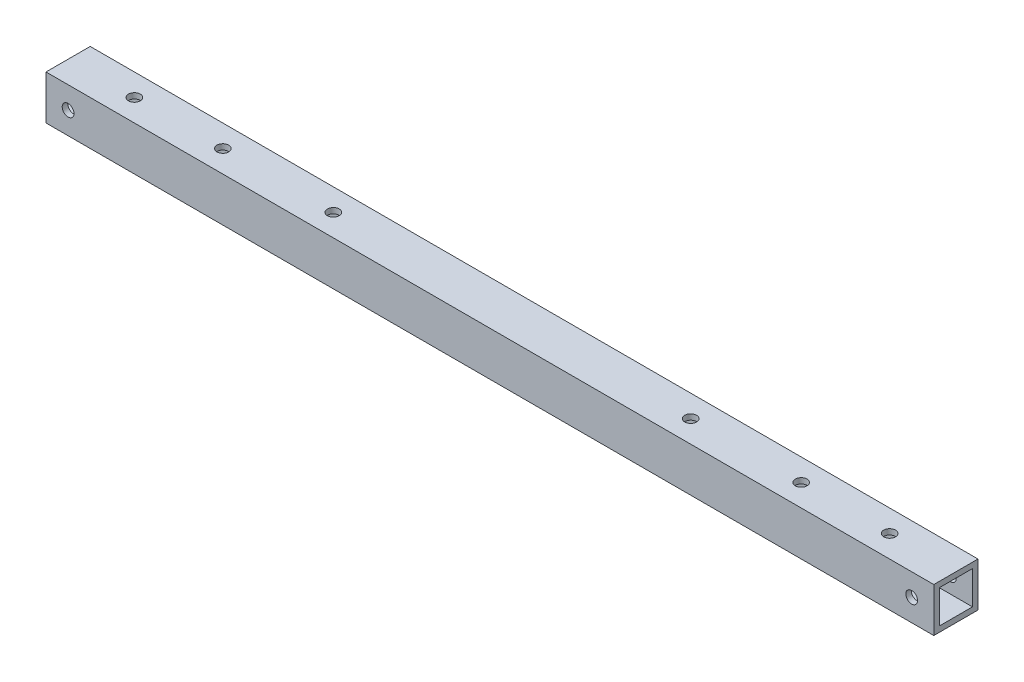
ISO-10303-21;
HEADER;
FILE_DESCRIPTION(('STEP AP214'),'2;1');
FILE_NAME('part.step','',(''),(''),'','','');
FILE_SCHEMA(('AUTOMOTIVE_DESIGN { 1 0 10303 214 1 1 1 1 }'));
ENDSEC;
DATA;
#1=APPLICATION_CONTEXT('core data for automotive mechanical design processes');
#2=APPLICATION_PROTOCOL_DEFINITION('international standard','automotive_design',2000,#1);
#3=PRODUCT_CONTEXT('',#1,'mechanical');
#4=PRODUCT('Part','Part','',(#3));
#5=PRODUCT_RELATED_PRODUCT_CATEGORY('part','',(#4));
#6=PRODUCT_DEFINITION_FORMATION('','',#4);
#7=PRODUCT_DEFINITION_CONTEXT('part definition',#1,'design');
#8=PRODUCT_DEFINITION('design','',#6,#7);
#9=PRODUCT_DEFINITION_SHAPE('','',#8);
#10=(LENGTH_UNIT() NAMED_UNIT(*) SI_UNIT(.MILLI.,.METRE.));
#11=(NAMED_UNIT(*) PLANE_ANGLE_UNIT() SI_UNIT($,.RADIAN.));
#12=(NAMED_UNIT(*) SI_UNIT($,.STERADIAN.) SOLID_ANGLE_UNIT());
#13=UNCERTAINTY_MEASURE_WITH_UNIT(LENGTH_MEASURE(1.E-05),#10,'distance_accuracy_value','');
#14=(GEOMETRIC_REPRESENTATION_CONTEXT(3) GLOBAL_UNCERTAINTY_ASSIGNED_CONTEXT((#13)) GLOBAL_UNIT_ASSIGNED_CONTEXT((#10,
#11,#12)) REPRESENTATION_CONTEXT('',''));
#15=CARTESIAN_POINT('',(0.,0.,0.));
#16=DIRECTION('',(0.,0.,1.));
#17=DIRECTION('',(1.,0.,0.));
#18=AXIS2_PLACEMENT_3D('',#15,#16,#17);
#19=CARTESIAN_POINT('',(241.,0.,0.));
#20=DIRECTION('',(1.,0.,0.));
#21=DIRECTION('',(0.,0.,-1.));
#22=AXIS2_PLACEMENT_3D('',#19,#20,#21);
#23=PLANE('',#22);
#24=DIRECTION('',(0.,1.,0.));
#25=VECTOR('',#24,1.);
#26=CARTESIAN_POINT('',(241.,12.,-12.));
#27=LINE('',#26,#25);
#28=CARTESIAN_POINT('',(241.,0.,-12.));
#29=VERTEX_POINT('',#28);
#30=CARTESIAN_POINT('',(241.,12.,-12.));
#31=VERTEX_POINT('',#30);
#32=EDGE_CURVE('E142',#29,#31,#27,.T.);
#33=ORIENTED_EDGE('',*,*,#32,.T.);
#34=DIRECTION('',(0.,0.,1.));
#35=VECTOR('',#34,1.);
#36=CARTESIAN_POINT('',(241.,12.,0.));
#37=LINE('',#36,#35);
#38=CARTESIAN_POINT('',(241.,12.,0.));
#39=VERTEX_POINT('',#38);
#40=EDGE_CURVE('E145',#31,#39,#37,.T.);
#41=ORIENTED_EDGE('',*,*,#40,.T.);
#42=DIRECTION('',(0.,-1.,0.));
#43=VECTOR('',#42,1.);
#44=CARTESIAN_POINT('',(241.,12.,0.));
#45=LINE('',#44,#43);
#46=CARTESIAN_POINT('',(241.,0.,0.));
#47=VERTEX_POINT('',#46);
#48=EDGE_CURVE('E148',#39,#47,#45,.T.);
#49=ORIENTED_EDGE('',*,*,#48,.T.);
#50=DIRECTION('',(0.,0.,-1.));
#51=VECTOR('',#50,1.);
#52=CARTESIAN_POINT('',(241.,0.,0.));
#53=LINE('',#52,#51);
#54=EDGE_CURVE('E150',#47,#29,#53,.T.);
#55=ORIENTED_EDGE('',*,*,#54,.T.);
#56=EDGE_LOOP('',(#33,#41,#49,#55));
#57=FACE_BOUND('',#56,.T.);
#58=DIRECTION('',(0.,0.,-1.));
#59=VECTOR('',#58,1.);
#60=CARTESIAN_POINT('',(241.,1.5,-1.5));
#61=LINE('',#60,#59);
#62=CARTESIAN_POINT('',(241.,1.5,-1.5));
#63=VERTEX_POINT('',#62);
#64=CARTESIAN_POINT('',(241.,1.5,-10.5));
#65=VERTEX_POINT('',#64);
#66=EDGE_CURVE('E112',#63,#65,#61,.T.);
#67=ORIENTED_EDGE('',*,*,#66,.F.);
#68=DIRECTION('',(0.,-1.,0.));
#69=VECTOR('',#68,1.);
#70=CARTESIAN_POINT('',(241.,10.5,-1.5));
#71=LINE('',#70,#69);
#72=CARTESIAN_POINT('',(241.,10.5,-1.5));
#73=VERTEX_POINT('',#72);
#74=EDGE_CURVE('E104',#73,#63,#71,.T.);
#75=ORIENTED_EDGE('',*,*,#74,.F.);
#76=DIRECTION('',(0.,0.,1.));
#77=VECTOR('',#76,1.);
#78=CARTESIAN_POINT('',(241.,10.5,-1.5));
#79=LINE('',#78,#77);
#80=CARTESIAN_POINT('',(241.,10.5,-10.5));
#81=VERTEX_POINT('',#80);
#82=EDGE_CURVE('E126',#81,#73,#79,.T.);
#83=ORIENTED_EDGE('',*,*,#82,.F.);
#84=DIRECTION('',(0.,1.,0.));
#85=VECTOR('',#84,1.);
#86=CARTESIAN_POINT('',(241.,10.5,-10.5));
#87=LINE('',#86,#85);
#88=EDGE_CURVE('E124',#65,#81,#87,.T.);
#89=ORIENTED_EDGE('',*,*,#88,.F.);
#90=EDGE_LOOP('',(#67,#75,#83,#89));
#91=FACE_BOUND('',#90,.T.);
#92=ADVANCED_FACE('F37',(#57,#91),#23,.T.);
#93=CARTESIAN_POINT('',(0.,0.,0.));
#94=DIRECTION('',(1.,0.,0.));
#95=DIRECTION('',(0.,0.,-1.));
#96=AXIS2_PLACEMENT_3D('',#93,#94,#95);
#97=PLANE('',#96);
#98=DIRECTION('',(0.,1.,0.));
#99=VECTOR('',#98,1.);
#100=CARTESIAN_POINT('',(0.,12.,-12.));
#101=LINE('',#100,#99);
#102=CARTESIAN_POINT('',(0.,0.,-12.));
#103=VERTEX_POINT('',#102);
#104=CARTESIAN_POINT('',(0.,12.,-12.));
#105=VERTEX_POINT('',#104);
#106=EDGE_CURVE('E120',#103,#105,#101,.T.);
#107=ORIENTED_EDGE('',*,*,#106,.F.);
#108=DIRECTION('',(0.,0.,-1.));
#109=VECTOR('',#108,1.);
#110=CARTESIAN_POINT('',(0.,0.,0.));
#111=LINE('',#110,#109);
#112=CARTESIAN_POINT('',(0.,0.,0.));
#113=VERTEX_POINT('',#112);
#114=EDGE_CURVE('E146',#113,#103,#111,.T.);
#115=ORIENTED_EDGE('',*,*,#114,.F.);
#116=DIRECTION('',(0.,-1.,0.));
#117=VECTOR('',#116,1.);
#118=CARTESIAN_POINT('',(0.,12.,0.));
#119=LINE('',#118,#117);
#120=CARTESIAN_POINT('',(0.,12.,0.));
#121=VERTEX_POINT('',#120);
#122=EDGE_CURVE('E157',#121,#113,#119,.T.);
#123=ORIENTED_EDGE('',*,*,#122,.F.);
#124=DIRECTION('',(0.,0.,1.));
#125=VECTOR('',#124,1.);
#126=CARTESIAN_POINT('',(0.,12.,0.));
#127=LINE('',#126,#125);
#128=EDGE_CURVE('E155',#105,#121,#127,.T.);
#129=ORIENTED_EDGE('',*,*,#128,.F.);
#130=EDGE_LOOP('',(#107,#115,#123,#129));
#131=FACE_BOUND('',#130,.T.);
#132=DIRECTION('',(0.,-1.,0.));
#133=VECTOR('',#132,1.);
#134=CARTESIAN_POINT('',(0.,10.5,-1.5));
#135=LINE('',#134,#133);
#136=CARTESIAN_POINT('',(0.,10.5,-1.5));
#137=VERTEX_POINT('',#136);
#138=CARTESIAN_POINT('',(0.,1.5,-1.5));
#139=VERTEX_POINT('',#138);
#140=EDGE_CURVE('E62',#137,#139,#135,.T.);
#141=ORIENTED_EDGE('',*,*,#140,.T.);
#142=DIRECTION('',(0.,0.,-1.));
#143=VECTOR('',#142,1.);
#144=CARTESIAN_POINT('',(0.,1.5,-1.5));
#145=LINE('',#144,#143);
#146=CARTESIAN_POINT('',(0.,1.5,-10.5));
#147=VERTEX_POINT('',#146);
#148=EDGE_CURVE('E119',#139,#147,#145,.T.);
#149=ORIENTED_EDGE('',*,*,#148,.T.);
#150=DIRECTION('',(0.,1.,0.));
#151=VECTOR('',#150,1.);
#152=CARTESIAN_POINT('',(0.,10.5,-10.5));
#153=LINE('',#152,#151);
#154=CARTESIAN_POINT('',(0.,10.5,-10.5));
#155=VERTEX_POINT('',#154);
#156=EDGE_CURVE('E134',#147,#155,#153,.T.);
#157=ORIENTED_EDGE('',*,*,#156,.T.);
#158=DIRECTION('',(0.,0.,1.));
#159=VECTOR('',#158,1.);
#160=CARTESIAN_POINT('',(0.,10.5,-1.5));
#161=LINE('',#160,#159);
#162=EDGE_CURVE('E113',#155,#137,#161,.T.);
#163=ORIENTED_EDGE('',*,*,#162,.T.);
#164=EDGE_LOOP('',(#141,#149,#157,#163));
#165=FACE_BOUND('',#164,.T.);
#166=ADVANCED_FACE('F273',(#131,#165),#97,.F.);
#167=CARTESIAN_POINT('',(241.,12.,-12.));
#168=DIRECTION('',(0.,0.,1.));
#169=DIRECTION('',(0.,-1.,0.));
#170=AXIS2_PLACEMENT_3D('',#167,#168,#169);
#171=PLANE('',#170);
#172=CARTESIAN_POINT('',(6.,6.,-12.));
#173=DIRECTION('',(0.,0.,1.));
#174=DIRECTION('',(1.,0.,0.));
#175=AXIS2_PLACEMENT_3D('',#172,#173,#174);
#176=CIRCLE('',#175,1.6);
#177=CARTESIAN_POINT('',(7.6,6.,-12.));
#178=VERTEX_POINT('',#177);
#179=EDGE_CURVE('E179',#178,#178,#176,.T.);
#180=ORIENTED_EDGE('',*,*,#179,.T.);
#181=EDGE_LOOP('',(#180));
#182=FACE_BOUND('',#181,.T.);
#183=CARTESIAN_POINT('',(235.,6.,-12.));
#184=DIRECTION('',(0.,0.,1.));
#185=DIRECTION('',(1.,0.,0.));
#186=AXIS2_PLACEMENT_3D('',#183,#184,#185);
#187=CIRCLE('',#186,1.59999999999996);
#188=CARTESIAN_POINT('',(236.6,6.,-12.));
#189=VERTEX_POINT('',#188);
#190=EDGE_CURVE('E215',#189,#189,#187,.T.);
#191=ORIENTED_EDGE('',*,*,#190,.T.);
#192=EDGE_LOOP('',(#191));
#193=FACE_BOUND('',#192,.T.);
#194=ORIENTED_EDGE('',*,*,#106,.T.);
#195=DIRECTION('',(-1.,0.,0.));
#196=VECTOR('',#195,1.);
#197=CARTESIAN_POINT('',(241.,12.,-12.));
#198=LINE('',#197,#196);
#199=EDGE_CURVE('E11',#31,#105,#198,.T.);
#200=ORIENTED_EDGE('',*,*,#199,.F.);
#201=ORIENTED_EDGE('',*,*,#32,.F.);
#202=DIRECTION('',(-1.,0.,0.));
#203=VECTOR('',#202,1.);
#204=CARTESIAN_POINT('',(241.,0.,-12.));
#205=LINE('',#204,#203);
#206=EDGE_CURVE('E152',#29,#103,#205,.T.);
#207=ORIENTED_EDGE('',*,*,#206,.T.);
#208=EDGE_LOOP('',(#194,#200,#201,#207));
#209=FACE_BOUND('',#208,.T.);
#210=ADVANCED_FACE('F39',(#182,#193,#209),#171,.F.);
#211=CARTESIAN_POINT('',(241.,12.,0.));
#212=DIRECTION('',(0.,-1.,0.));
#213=DIRECTION('',(0.,0.,-1.));
#214=AXIS2_PLACEMENT_3D('',#211,#212,#213);
#215=PLANE('',#214);
#216=CARTESIAN_POINT('',(42.,12.,-5.99999999999996));
#217=DIRECTION('',(0.,-1.,0.));
#218=DIRECTION('',(0.,0.,-1.));
#219=AXIS2_PLACEMENT_3D('',#216,#217,#218);
#220=CIRCLE('',#219,1.6);
#221=CARTESIAN_POINT('',(42.,12.,-7.59999999999996));
#222=VERTEX_POINT('',#221);
#223=EDGE_CURVE('E361',#222,#222,#220,.T.);
#224=ORIENTED_EDGE('',*,*,#223,.T.);
#225=EDGE_LOOP('',(#224));
#226=FACE_BOUND('',#225,.T.);
#227=CARTESIAN_POINT('',(199.,12.,-6.00000000000003));
#228=DIRECTION('',(0.,-1.,0.));
#229=DIRECTION('',(0.,0.,-1.));
#230=AXIS2_PLACEMENT_3D('',#227,#228,#229);
#231=CIRCLE('',#230,1.59999999999999);
#232=CARTESIAN_POINT('',(199.,12.,-7.60000000000002));
#233=VERTEX_POINT('',#232);
#234=EDGE_CURVE('E368',#233,#233,#231,.T.);
#235=ORIENTED_EDGE('',*,*,#234,.T.);
#236=EDGE_LOOP('',(#235));
#237=FACE_BOUND('',#236,.T.);
#238=CARTESIAN_POINT('',(169.,12.,-6.00000000000003));
#239=DIRECTION('',(0.,-1.,0.));
#240=DIRECTION('',(0.,0.,-1.));
#241=AXIS2_PLACEMENT_3D('',#238,#239,#240);
#242=CIRCLE('',#241,1.59999999999999);
#243=CARTESIAN_POINT('',(169.,12.,-7.60000000000002));
#244=VERTEX_POINT('',#243);
#245=EDGE_CURVE('E355',#244,#244,#242,.T.);
#246=ORIENTED_EDGE('',*,*,#245,.T.);
#247=EDGE_LOOP('',(#246));
#248=FACE_BOUND('',#247,.T.);
#249=CARTESIAN_POINT('',(72.,12.,-5.99999999999996));
#250=DIRECTION('',(0.,-1.,0.));
#251=DIRECTION('',(0.,0.,-1.));
#252=AXIS2_PLACEMENT_3D('',#249,#250,#251);
#253=CIRCLE('',#252,1.60000000000001);
#254=CARTESIAN_POINT('',(72.,12.,-7.59999999999996));
#255=VERTEX_POINT('',#254);
#256=EDGE_CURVE('E188',#255,#255,#253,.T.);
#257=ORIENTED_EDGE('',*,*,#256,.T.);
#258=EDGE_LOOP('',(#257));
#259=FACE_BOUND('',#258,.T.);
#260=CARTESIAN_POINT('',(18.,12.,-6.));
#261=DIRECTION('',(0.,1.,0.));
#262=DIRECTION('',(0.,0.,1.));
#263=AXIS2_PLACEMENT_3D('',#260,#261,#262);
#264=CIRCLE('',#263,1.6);
#265=CARTESIAN_POINT('',(18.,12.,-4.4));
#266=VERTEX_POINT('',#265);
#267=EDGE_CURVE('E227',#266,#266,#264,.T.);
#268=ORIENTED_EDGE('',*,*,#267,.F.);
#269=EDGE_LOOP('',(#268));
#270=FACE_BOUND('',#269,.T.);
#271=CARTESIAN_POINT('',(223.,12.,-6.));
#272=DIRECTION('',(0.,1.,0.));
#273=DIRECTION('',(0.,0.,1.));
#274=AXIS2_PLACEMENT_3D('',#271,#272,#273);
#275=CIRCLE('',#274,1.59999999999996);
#276=CARTESIAN_POINT('',(223.,12.,-4.40000000000004));
#277=VERTEX_POINT('',#276);
#278=EDGE_CURVE('E224',#277,#277,#275,.T.);
#279=ORIENTED_EDGE('',*,*,#278,.F.);
#280=EDGE_LOOP('',(#279));
#281=FACE_BOUND('',#280,.T.);
#282=ORIENTED_EDGE('',*,*,#128,.T.);
#283=DIRECTION('',(-1.,0.,0.));
#284=VECTOR('',#283,1.);
#285=CARTESIAN_POINT('',(241.,12.,0.));
#286=LINE('',#285,#284);
#287=EDGE_CURVE('E46',#39,#121,#286,.T.);
#288=ORIENTED_EDGE('',*,*,#287,.F.);
#289=ORIENTED_EDGE('',*,*,#40,.F.);
#290=ORIENTED_EDGE('',*,*,#199,.T.);
#291=EDGE_LOOP('',(#282,#288,#289,#290));
#292=FACE_BOUND('',#291,.T.);
#293=ADVANCED_FACE('F277',(#226,#237,#248,#259,#270,#281,#292),#215,.F.);
#294=CARTESIAN_POINT('',(241.,12.,0.));
#295=DIRECTION('',(0.,0.,-1.));
#296=DIRECTION('',(0.,1.,0.));
#297=AXIS2_PLACEMENT_3D('',#294,#295,#296);
#298=PLANE('',#297);
#299=CARTESIAN_POINT('',(6.,6.,0.));
#300=DIRECTION('',(0.,0.,1.));
#301=DIRECTION('',(1.,0.,0.));
#302=AXIS2_PLACEMENT_3D('',#299,#300,#301);
#303=CIRCLE('',#302,1.6);
#304=CARTESIAN_POINT('',(7.6,6.,0.));
#305=VERTEX_POINT('',#304);
#306=EDGE_CURVE('E212',#305,#305,#303,.T.);
#307=ORIENTED_EDGE('',*,*,#306,.F.);
#308=EDGE_LOOP('',(#307));
#309=FACE_BOUND('',#308,.T.);
#310=CARTESIAN_POINT('',(235.,6.,0.));
#311=DIRECTION('',(0.,0.,1.));
#312=DIRECTION('',(1.,0.,0.));
#313=AXIS2_PLACEMENT_3D('',#310,#311,#312);
#314=CIRCLE('',#313,1.59999999999996);
#315=CARTESIAN_POINT('',(236.6,6.,0.));
#316=VERTEX_POINT('',#315);
#317=EDGE_CURVE('E209',#316,#316,#314,.T.);
#318=ORIENTED_EDGE('',*,*,#317,.F.);
#319=EDGE_LOOP('',(#318));
#320=FACE_BOUND('',#319,.T.);
#321=ORIENTED_EDGE('',*,*,#122,.T.);
#322=DIRECTION('',(-1.,0.,0.));
#323=VECTOR('',#322,1.);
#324=CARTESIAN_POINT('',(241.,0.,0.));
#325=LINE('',#324,#323);
#326=EDGE_CURVE('E162',#47,#113,#325,.T.);
#327=ORIENTED_EDGE('',*,*,#326,.F.);
#328=ORIENTED_EDGE('',*,*,#48,.F.);
#329=ORIENTED_EDGE('',*,*,#287,.T.);
#330=EDGE_LOOP('',(#321,#327,#328,#329));
#331=FACE_BOUND('',#330,.T.);
#332=ADVANCED_FACE('F260',(#309,#320,#331),#298,.F.);
#333=CARTESIAN_POINT('',(241.,0.,0.));
#334=DIRECTION('',(0.,1.,0.));
#335=DIRECTION('',(0.,0.,1.));
#336=AXIS2_PLACEMENT_3D('',#333,#334,#335);
#337=PLANE('',#336);
#338=CARTESIAN_POINT('',(42.,0.,-5.99999999999996));
#339=DIRECTION('',(0.,-1.,0.));
#340=DIRECTION('',(0.,0.,-1.));
#341=AXIS2_PLACEMENT_3D('',#338,#339,#340);
#342=CIRCLE('',#341,1.6);
#343=CARTESIAN_POINT('',(42.,0.,-7.59999999999996));
#344=VERTEX_POINT('',#343);
#345=EDGE_CURVE('E365',#344,#344,#342,.T.);
#346=ORIENTED_EDGE('',*,*,#345,.F.);
#347=EDGE_LOOP('',(#346));
#348=FACE_BOUND('',#347,.T.);
#349=CARTESIAN_POINT('',(199.,0.,-6.00000000000003));
#350=DIRECTION('',(0.,-1.,0.));
#351=DIRECTION('',(0.,0.,-1.));
#352=AXIS2_PLACEMENT_3D('',#349,#350,#351);
#353=CIRCLE('',#352,1.59999999999999);
#354=CARTESIAN_POINT('',(199.,0.,-7.60000000000002));
#355=VERTEX_POINT('',#354);
#356=EDGE_CURVE('E358',#355,#355,#353,.T.);
#357=ORIENTED_EDGE('',*,*,#356,.F.);
#358=EDGE_LOOP('',(#357));
#359=FACE_BOUND('',#358,.T.);
#360=CARTESIAN_POINT('',(169.,0.,-6.00000000000003));
#361=DIRECTION('',(0.,-1.,0.));
#362=DIRECTION('',(0.,0.,-1.));
#363=AXIS2_PLACEMENT_3D('',#360,#361,#362);
#364=CIRCLE('',#363,1.59999999999999);
#365=CARTESIAN_POINT('',(169.,0.,-7.60000000000002));
#366=VERTEX_POINT('',#365);
#367=EDGE_CURVE('E353',#366,#366,#364,.T.);
#368=ORIENTED_EDGE('',*,*,#367,.F.);
#369=EDGE_LOOP('',(#368));
#370=FACE_BOUND('',#369,.T.);
#371=CARTESIAN_POINT('',(72.,0.,-5.99999999999996));
#372=DIRECTION('',(0.,-1.,0.));
#373=DIRECTION('',(0.,0.,-1.));
#374=AXIS2_PLACEMENT_3D('',#371,#372,#373);
#375=CIRCLE('',#374,1.60000000000001);
#376=CARTESIAN_POINT('',(72.,0.,-7.59999999999996));
#377=VERTEX_POINT('',#376);
#378=EDGE_CURVE('E364',#377,#377,#375,.T.);
#379=ORIENTED_EDGE('',*,*,#378,.F.);
#380=EDGE_LOOP('',(#379));
#381=FACE_BOUND('',#380,.T.);
#382=CARTESIAN_POINT('',(18.,0.,-6.));
#383=DIRECTION('',(0.,1.,0.));
#384=DIRECTION('',(0.,0.,1.));
#385=AXIS2_PLACEMENT_3D('',#382,#383,#384);
#386=CIRCLE('',#385,1.6);
#387=CARTESIAN_POINT('',(18.,0.,-4.4));
#388=VERTEX_POINT('',#387);
#389=EDGE_CURVE('E171',#388,#388,#386,.T.);
#390=ORIENTED_EDGE('',*,*,#389,.T.);
#391=EDGE_LOOP('',(#390));
#392=FACE_BOUND('',#391,.T.);
#393=CARTESIAN_POINT('',(223.,0.,-6.));
#394=DIRECTION('',(0.,1.,0.));
#395=DIRECTION('',(0.,0.,1.));
#396=AXIS2_PLACEMENT_3D('',#393,#394,#395);
#397=CIRCLE('',#396,1.59999999999996);
#398=CARTESIAN_POINT('',(223.,0.,-4.40000000000004));
#399=VERTEX_POINT('',#398);
#400=EDGE_CURVE('E230',#399,#399,#397,.T.);
#401=ORIENTED_EDGE('',*,*,#400,.T.);
#402=EDGE_LOOP('',(#401));
#403=FACE_BOUND('',#402,.T.);
#404=ORIENTED_EDGE('',*,*,#114,.T.);
#405=ORIENTED_EDGE('',*,*,#206,.F.);
#406=ORIENTED_EDGE('',*,*,#54,.F.);
#407=ORIENTED_EDGE('',*,*,#326,.T.);
#408=EDGE_LOOP('',(#404,#405,#406,#407));
#409=FACE_BOUND('',#408,.T.);
#410=ADVANCED_FACE('F257',(#348,#359,#370,#381,#392,#403,#409),#337,.F.);
#411=CARTESIAN_POINT('',(241.,10.5,-1.5));
#412=DIRECTION('',(0.,0.,-1.));
#413=DIRECTION('',(-1.,0.,0.));
#414=AXIS2_PLACEMENT_3D('',#411,#412,#413);
#415=PLANE('',#414);
#416=CARTESIAN_POINT('',(6.,6.,-1.5));
#417=DIRECTION('',(0.,0.,-1.));
#418=DIRECTION('',(-1.,0.,0.));
#419=AXIS2_PLACEMENT_3D('',#416,#417,#418);
#420=CIRCLE('',#419,1.6);
#421=CARTESIAN_POINT('',(4.4,6.,-1.5));
#422=VERTEX_POINT('',#421);
#423=EDGE_CURVE('E183',#422,#422,#420,.T.);
#424=ORIENTED_EDGE('',*,*,#423,.F.);
#425=EDGE_LOOP('',(#424));
#426=FACE_BOUND('',#425,.T.);
#427=CARTESIAN_POINT('',(235.,6.,-1.5));
#428=DIRECTION('',(0.,0.,-1.));
#429=DIRECTION('',(-1.,0.,0.));
#430=AXIS2_PLACEMENT_3D('',#427,#428,#429);
#431=CIRCLE('',#430,1.59999999999996);
#432=CARTESIAN_POINT('',(233.4,6.,-1.5));
#433=VERTEX_POINT('',#432);
#434=EDGE_CURVE('E178',#433,#433,#431,.T.);
#435=ORIENTED_EDGE('',*,*,#434,.F.);
#436=EDGE_LOOP('',(#435));
#437=FACE_BOUND('',#436,.T.);
#438=ORIENTED_EDGE('',*,*,#140,.F.);
#439=DIRECTION('',(-1.,0.,0.));
#440=VECTOR('',#439,1.);
#441=CARTESIAN_POINT('',(241.,10.5,-1.5));
#442=LINE('',#441,#440);
#443=EDGE_CURVE('E108',#73,#137,#442,.T.);
#444=ORIENTED_EDGE('',*,*,#443,.F.);
#445=ORIENTED_EDGE('',*,*,#74,.T.);
#446=DIRECTION('',(-1.,0.,0.));
#447=VECTOR('',#446,1.);
#448=CARTESIAN_POINT('',(241.,1.5,-1.5));
#449=LINE('',#448,#447);
#450=EDGE_CURVE('E107',#63,#139,#449,.T.);
#451=ORIENTED_EDGE('',*,*,#450,.T.);
#452=EDGE_LOOP('',(#438,#444,#445,#451));
#453=FACE_BOUND('',#452,.T.);
#454=ADVANCED_FACE('F106',(#426,#437,#453),#415,.T.);
#455=CARTESIAN_POINT('',(241.,1.5,-1.5));
#456=DIRECTION('',(0.,1.,0.));
#457=DIRECTION('',(0.,0.,1.));
#458=AXIS2_PLACEMENT_3D('',#455,#456,#457);
#459=PLANE('',#458);
#460=CARTESIAN_POINT('',(42.,1.5,-5.99999999999996));
#461=DIRECTION('',(0.,1.,0.));
#462=DIRECTION('',(0.,0.,1.));
#463=AXIS2_PLACEMENT_3D('',#460,#461,#462);
#464=CIRCLE('',#463,1.6);
#465=CARTESIAN_POINT('',(42.,1.5,-4.39999999999996));
#466=VERTEX_POINT('',#465);
#467=EDGE_CURVE('E206',#466,#466,#464,.T.);
#468=ORIENTED_EDGE('',*,*,#467,.F.);
#469=EDGE_LOOP('',(#468));
#470=FACE_BOUND('',#469,.T.);
#471=CARTESIAN_POINT('',(199.,1.5,-6.00000000000003));
#472=DIRECTION('',(0.,1.,0.));
#473=DIRECTION('',(0.,0.,1.));
#474=AXIS2_PLACEMENT_3D('',#471,#472,#473);
#475=CIRCLE('',#474,1.59999999999999);
#476=CARTESIAN_POINT('',(199.,1.5,-4.40000000000004));
#477=VERTEX_POINT('',#476);
#478=EDGE_CURVE('E194',#477,#477,#475,.T.);
#479=ORIENTED_EDGE('',*,*,#478,.F.);
#480=EDGE_LOOP('',(#479));
#481=FACE_BOUND('',#480,.T.);
#482=CARTESIAN_POINT('',(169.,1.5,-6.00000000000003));
#483=DIRECTION('',(0.,1.,0.));
#484=DIRECTION('',(0.,0.,1.));
#485=AXIS2_PLACEMENT_3D('',#482,#483,#484);
#486=CIRCLE('',#485,1.59999999999999);
#487=CARTESIAN_POINT('',(169.,1.5,-4.40000000000004));
#488=VERTEX_POINT('',#487);
#489=EDGE_CURVE('E191',#488,#488,#486,.T.);
#490=ORIENTED_EDGE('',*,*,#489,.F.);
#491=EDGE_LOOP('',(#490));
#492=FACE_BOUND('',#491,.T.);
#493=CARTESIAN_POINT('',(72.,1.5,-5.99999999999996));
#494=DIRECTION('',(0.,1.,0.));
#495=DIRECTION('',(0.,0.,1.));
#496=AXIS2_PLACEMENT_3D('',#493,#494,#495);
#497=CIRCLE('',#496,1.60000000000001);
#498=CARTESIAN_POINT('',(72.,1.5,-4.39999999999995));
#499=VERTEX_POINT('',#498);
#500=EDGE_CURVE('E187',#499,#499,#497,.T.);
#501=ORIENTED_EDGE('',*,*,#500,.F.);
#502=EDGE_LOOP('',(#501));
#503=FACE_BOUND('',#502,.T.);
#504=CARTESIAN_POINT('',(18.,1.5,-6.));
#505=DIRECTION('',(0.,1.,0.));
#506=DIRECTION('',(0.,0.,1.));
#507=AXIS2_PLACEMENT_3D('',#504,#505,#506);
#508=CIRCLE('',#507,1.6);
#509=CARTESIAN_POINT('',(18.,1.5,-4.4));
#510=VERTEX_POINT('',#509);
#511=EDGE_CURVE('E132',#510,#510,#508,.T.);
#512=ORIENTED_EDGE('',*,*,#511,.F.);
#513=EDGE_LOOP('',(#512));
#514=FACE_BOUND('',#513,.T.);
#515=CARTESIAN_POINT('',(223.,1.5,-6.));
#516=DIRECTION('',(0.,1.,0.));
#517=DIRECTION('',(0.,0.,1.));
#518=AXIS2_PLACEMENT_3D('',#515,#516,#517);
#519=CIRCLE('',#518,1.59999999999996);
#520=CARTESIAN_POINT('',(223.,1.5,-4.40000000000004));
#521=VERTEX_POINT('',#520);
#522=EDGE_CURVE('E170',#521,#521,#519,.T.);
#523=ORIENTED_EDGE('',*,*,#522,.F.);
#524=EDGE_LOOP('',(#523));
#525=FACE_BOUND('',#524,.T.);
#526=ORIENTED_EDGE('',*,*,#148,.F.);
#527=ORIENTED_EDGE('',*,*,#450,.F.);
#528=ORIENTED_EDGE('',*,*,#66,.T.);
#529=DIRECTION('',(-1.,0.,0.));
#530=VECTOR('',#529,1.);
#531=CARTESIAN_POINT('',(241.,1.5,-10.5));
#532=LINE('',#531,#530);
#533=EDGE_CURVE('E121',#65,#147,#532,.T.);
#534=ORIENTED_EDGE('',*,*,#533,.T.);
#535=EDGE_LOOP('',(#526,#527,#528,#534));
#536=FACE_BOUND('',#535,.T.);
#537=ADVANCED_FACE('F116',(#470,#481,#492,#503,#514,#525,#536),#459,.T.);
#538=CARTESIAN_POINT('',(241.,10.5,-10.5));
#539=DIRECTION('',(0.,0.,1.));
#540=DIRECTION('',(0.,-1.,0.));
#541=AXIS2_PLACEMENT_3D('',#538,#539,#540);
#542=PLANE('',#541);
#543=CARTESIAN_POINT('',(6.,6.,-10.5));
#544=DIRECTION('',(0.,0.,1.));
#545=DIRECTION('',(0.,-1.,0.));
#546=AXIS2_PLACEMENT_3D('',#543,#544,#545);
#547=CIRCLE('',#546,1.6);
#548=CARTESIAN_POINT('',(6.,4.4,-10.5));
#549=VERTEX_POINT('',#548);
#550=EDGE_CURVE('E180',#549,#549,#547,.T.);
#551=ORIENTED_EDGE('',*,*,#550,.F.);
#552=EDGE_LOOP('',(#551));
#553=FACE_BOUND('',#552,.T.);
#554=CARTESIAN_POINT('',(235.,6.,-10.5));
#555=DIRECTION('',(0.,0.,1.));
#556=DIRECTION('',(0.,-1.,0.));
#557=AXIS2_PLACEMENT_3D('',#554,#555,#556);
#558=CIRCLE('',#557,1.59999999999996);
#559=CARTESIAN_POINT('',(235.,4.40000000000004,-10.5));
#560=VERTEX_POINT('',#559);
#561=EDGE_CURVE('E175',#560,#560,#558,.T.);
#562=ORIENTED_EDGE('',*,*,#561,.F.);
#563=EDGE_LOOP('',(#562));
#564=FACE_BOUND('',#563,.T.);
#565=ORIENTED_EDGE('',*,*,#156,.F.);
#566=ORIENTED_EDGE('',*,*,#533,.F.);
#567=ORIENTED_EDGE('',*,*,#88,.T.);
#568=DIRECTION('',(-1.,0.,0.));
#569=VECTOR('',#568,1.);
#570=CARTESIAN_POINT('',(241.,10.5,-10.5));
#571=LINE('',#570,#569);
#572=EDGE_CURVE('E54',#81,#155,#571,.T.);
#573=ORIENTED_EDGE('',*,*,#572,.T.);
#574=EDGE_LOOP('',(#565,#566,#567,#573));
#575=FACE_BOUND('',#574,.T.);
#576=ADVANCED_FACE('F244',(#553,#564,#575),#542,.T.);
#577=CARTESIAN_POINT('',(241.,10.5,-1.5));
#578=DIRECTION('',(0.,-1.,0.));
#579=DIRECTION('',(0.,0.,-1.));
#580=AXIS2_PLACEMENT_3D('',#577,#578,#579);
#581=PLANE('',#580);
#582=CARTESIAN_POINT('',(42.,10.5,-5.99999999999996));
#583=DIRECTION('',(0.,-1.,0.));
#584=DIRECTION('',(0.,0.,-1.));
#585=AXIS2_PLACEMENT_3D('',#582,#583,#584);
#586=CIRCLE('',#585,1.6);
#587=CARTESIAN_POINT('',(42.,10.5,-7.59999999999996));
#588=VERTEX_POINT('',#587);
#589=EDGE_CURVE('E41',#588,#588,#586,.T.);
#590=ORIENTED_EDGE('',*,*,#589,.F.);
#591=EDGE_LOOP('',(#590));
#592=FACE_BOUND('',#591,.T.);
#593=CARTESIAN_POINT('',(199.,10.5,-6.00000000000003));
#594=DIRECTION('',(0.,-1.,0.));
#595=DIRECTION('',(0.,0.,-1.));
#596=AXIS2_PLACEMENT_3D('',#593,#594,#595);
#597=CIRCLE('',#596,1.59999999999999);
#598=CARTESIAN_POINT('',(199.,10.5,-7.60000000000002));
#599=VERTEX_POINT('',#598);
#600=EDGE_CURVE('E192',#599,#599,#597,.T.);
#601=ORIENTED_EDGE('',*,*,#600,.F.);
#602=EDGE_LOOP('',(#601));
#603=FACE_BOUND('',#602,.T.);
#604=CARTESIAN_POINT('',(169.,10.5,-6.00000000000003));
#605=DIRECTION('',(0.,-1.,0.));
#606=DIRECTION('',(0.,0.,-1.));
#607=AXIS2_PLACEMENT_3D('',#604,#605,#606);
#608=CIRCLE('',#607,1.59999999999999);
#609=CARTESIAN_POINT('',(169.,10.5,-7.60000000000002));
#610=VERTEX_POINT('',#609);
#611=EDGE_CURVE('E189',#610,#610,#608,.T.);
#612=ORIENTED_EDGE('',*,*,#611,.F.);
#613=EDGE_LOOP('',(#612));
#614=FACE_BOUND('',#613,.T.);
#615=CARTESIAN_POINT('',(72.,10.5,-5.99999999999996));
#616=DIRECTION('',(0.,-1.,0.));
#617=DIRECTION('',(0.,0.,-1.));
#618=AXIS2_PLACEMENT_3D('',#615,#616,#617);
#619=CIRCLE('',#618,1.60000000000001);
#620=CARTESIAN_POINT('',(72.,10.5,-7.59999999999996));
#621=VERTEX_POINT('',#620);
#622=EDGE_CURVE('E184',#621,#621,#619,.T.);
#623=ORIENTED_EDGE('',*,*,#622,.F.);
#624=EDGE_LOOP('',(#623));
#625=FACE_BOUND('',#624,.T.);
#626=CARTESIAN_POINT('',(18.,10.5,-6.));
#627=DIRECTION('',(0.,-1.,0.));
#628=DIRECTION('',(0.,0.,-1.));
#629=AXIS2_PLACEMENT_3D('',#626,#627,#628);
#630=CIRCLE('',#629,1.6);
#631=CARTESIAN_POINT('',(18.,10.5,-7.6));
#632=VERTEX_POINT('',#631);
#633=EDGE_CURVE('E172',#632,#632,#630,.T.);
#634=ORIENTED_EDGE('',*,*,#633,.F.);
#635=EDGE_LOOP('',(#634));
#636=FACE_BOUND('',#635,.T.);
#637=CARTESIAN_POINT('',(223.,10.5,-6.));
#638=DIRECTION('',(0.,-1.,0.));
#639=DIRECTION('',(0.,0.,-1.));
#640=AXIS2_PLACEMENT_3D('',#637,#638,#639);
#641=CIRCLE('',#640,1.59999999999996);
#642=CARTESIAN_POINT('',(223.,10.5,-7.59999999999996));
#643=VERTEX_POINT('',#642);
#644=EDGE_CURVE('E167',#643,#643,#641,.T.);
#645=ORIENTED_EDGE('',*,*,#644,.F.);
#646=EDGE_LOOP('',(#645));
#647=FACE_BOUND('',#646,.T.);
#648=ORIENTED_EDGE('',*,*,#162,.F.);
#649=ORIENTED_EDGE('',*,*,#572,.F.);
#650=ORIENTED_EDGE('',*,*,#82,.T.);
#651=ORIENTED_EDGE('',*,*,#443,.T.);
#652=EDGE_LOOP('',(#648,#649,#650,#651));
#653=FACE_BOUND('',#652,.T.);
#654=ADVANCED_FACE('F302',(#592,#603,#614,#625,#636,#647,#653),#581,.T.);
#655=CARTESIAN_POINT('',(223.,0.,-6.));
#656=DIRECTION('',(0.,1.,0.));
#657=DIRECTION('',(0.,0.,1.));
#658=AXIS2_PLACEMENT_3D('',#655,#656,#657);
#659=CYLINDRICAL_SURFACE('',#658,1.59999999999996);
#660=ORIENTED_EDGE('',*,*,#644,.T.);
#661=EDGE_LOOP('',(#660));
#662=FACE_BOUND('',#661,.T.);
#663=ORIENTED_EDGE('',*,*,#278,.T.);
#664=EDGE_LOOP('',(#663));
#665=FACE_BOUND('',#664,.T.);
#666=ADVANCED_FACE('F254',(#662,#665),#659,.F.);
#667=CARTESIAN_POINT('',(18.,0.,-6.));
#668=DIRECTION('',(0.,1.,0.));
#669=DIRECTION('',(0.,0.,1.));
#670=AXIS2_PLACEMENT_3D('',#667,#668,#669);
#671=CYLINDRICAL_SURFACE('',#670,1.6);
#672=ORIENTED_EDGE('',*,*,#633,.T.);
#673=EDGE_LOOP('',(#672));
#674=FACE_BOUND('',#673,.T.);
#675=ORIENTED_EDGE('',*,*,#267,.T.);
#676=EDGE_LOOP('',(#675));
#677=FACE_BOUND('',#676,.T.);
#678=ADVANCED_FACE('F252',(#674,#677),#671,.F.);
#679=ORIENTED_EDGE('',*,*,#522,.T.);
#680=EDGE_LOOP('',(#679));
#681=FACE_BOUND('',#680,.T.);
#682=ORIENTED_EDGE('',*,*,#400,.F.);
#683=EDGE_LOOP('',(#682));
#684=FACE_BOUND('',#683,.T.);
#685=ADVANCED_FACE('F249',(#681,#684),#659,.F.);
#686=ORIENTED_EDGE('',*,*,#511,.T.);
#687=EDGE_LOOP('',(#686));
#688=FACE_BOUND('',#687,.T.);
#689=ORIENTED_EDGE('',*,*,#389,.F.);
#690=EDGE_LOOP('',(#689));
#691=FACE_BOUND('',#690,.T.);
#692=ADVANCED_FACE('F239',(#688,#691),#671,.F.);
#693=CARTESIAN_POINT('',(235.,6.,-12.));
#694=DIRECTION('',(0.,0.,1.));
#695=DIRECTION('',(1.,0.,0.));
#696=AXIS2_PLACEMENT_3D('',#693,#694,#695);
#697=CYLINDRICAL_SURFACE('',#696,1.59999999999996);
#698=ORIENTED_EDGE('',*,*,#561,.T.);
#699=EDGE_LOOP('',(#698));
#700=FACE_BOUND('',#699,.T.);
#701=ORIENTED_EDGE('',*,*,#190,.F.);
#702=EDGE_LOOP('',(#701));
#703=FACE_BOUND('',#702,.T.);
#704=ADVANCED_FACE('F312',(#700,#703),#697,.F.);
#705=CARTESIAN_POINT('',(6.,6.,-12.));
#706=DIRECTION('',(0.,0.,1.));
#707=DIRECTION('',(1.,0.,0.));
#708=AXIS2_PLACEMENT_3D('',#705,#706,#707);
#709=CYLINDRICAL_SURFACE('',#708,1.6);
#710=ORIENTED_EDGE('',*,*,#550,.T.);
#711=EDGE_LOOP('',(#710));
#712=FACE_BOUND('',#711,.T.);
#713=ORIENTED_EDGE('',*,*,#179,.F.);
#714=EDGE_LOOP('',(#713));
#715=FACE_BOUND('',#714,.T.);
#716=ADVANCED_FACE('F315',(#712,#715),#709,.F.);
#717=ORIENTED_EDGE('',*,*,#434,.T.);
#718=EDGE_LOOP('',(#717));
#719=FACE_BOUND('',#718,.T.);
#720=ORIENTED_EDGE('',*,*,#317,.T.);
#721=EDGE_LOOP('',(#720));
#722=FACE_BOUND('',#721,.T.);
#723=ADVANCED_FACE('F317',(#719,#722),#697,.F.);
#724=ORIENTED_EDGE('',*,*,#423,.T.);
#725=EDGE_LOOP('',(#724));
#726=FACE_BOUND('',#725,.T.);
#727=ORIENTED_EDGE('',*,*,#306,.T.);
#728=EDGE_LOOP('',(#727));
#729=FACE_BOUND('',#728,.T.);
#730=ADVANCED_FACE('F321',(#726,#729),#709,.F.);
#731=CARTESIAN_POINT('',(72.,12.,-5.99999999999996));
#732=DIRECTION('',(0.,-1.,0.));
#733=DIRECTION('',(0.,0.,-1.));
#734=AXIS2_PLACEMENT_3D('',#731,#732,#733);
#735=CYLINDRICAL_SURFACE('',#734,1.60000000000001);
#736=ORIENTED_EDGE('',*,*,#622,.T.);
#737=EDGE_LOOP('',(#736));
#738=FACE_BOUND('',#737,.T.);
#739=ORIENTED_EDGE('',*,*,#256,.F.);
#740=EDGE_LOOP('',(#739));
#741=FACE_BOUND('',#740,.T.);
#742=ADVANCED_FACE('F322',(#738,#741),#735,.F.);
#743=CARTESIAN_POINT('',(169.,12.,-6.00000000000003));
#744=DIRECTION('',(0.,-1.,0.));
#745=DIRECTION('',(0.,0.,-1.));
#746=AXIS2_PLACEMENT_3D('',#743,#744,#745);
#747=CYLINDRICAL_SURFACE('',#746,1.59999999999999);
#748=ORIENTED_EDGE('',*,*,#611,.T.);
#749=EDGE_LOOP('',(#748));
#750=FACE_BOUND('',#749,.T.);
#751=ORIENTED_EDGE('',*,*,#245,.F.);
#752=EDGE_LOOP('',(#751));
#753=FACE_BOUND('',#752,.T.);
#754=ADVANCED_FACE('F325',(#750,#753),#747,.F.);
#755=CARTESIAN_POINT('',(199.,12.,-6.00000000000003));
#756=DIRECTION('',(0.,-1.,0.));
#757=DIRECTION('',(0.,0.,-1.));
#758=AXIS2_PLACEMENT_3D('',#755,#756,#757);
#759=CYLINDRICAL_SURFACE('',#758,1.59999999999999);
#760=ORIENTED_EDGE('',*,*,#600,.T.);
#761=EDGE_LOOP('',(#760));
#762=FACE_BOUND('',#761,.T.);
#763=ORIENTED_EDGE('',*,*,#234,.F.);
#764=EDGE_LOOP('',(#763));
#765=FACE_BOUND('',#764,.T.);
#766=ADVANCED_FACE('F328',(#762,#765),#759,.F.);
#767=CARTESIAN_POINT('',(42.,12.,-5.99999999999996));
#768=DIRECTION('',(0.,-1.,0.));
#769=DIRECTION('',(0.,0.,-1.));
#770=AXIS2_PLACEMENT_3D('',#767,#768,#769);
#771=CYLINDRICAL_SURFACE('',#770,1.6);
#772=ORIENTED_EDGE('',*,*,#589,.T.);
#773=EDGE_LOOP('',(#772));
#774=FACE_BOUND('',#773,.T.);
#775=ORIENTED_EDGE('',*,*,#223,.F.);
#776=EDGE_LOOP('',(#775));
#777=FACE_BOUND('',#776,.T.);
#778=ADVANCED_FACE('F331',(#774,#777),#771,.F.);
#779=ORIENTED_EDGE('',*,*,#500,.T.);
#780=EDGE_LOOP('',(#779));
#781=FACE_BOUND('',#780,.T.);
#782=ORIENTED_EDGE('',*,*,#378,.T.);
#783=EDGE_LOOP('',(#782));
#784=FACE_BOUND('',#783,.T.);
#785=ADVANCED_FACE('F327',(#781,#784),#735,.F.);
#786=ORIENTED_EDGE('',*,*,#489,.T.);
#787=EDGE_LOOP('',(#786));
#788=FACE_BOUND('',#787,.T.);
#789=ORIENTED_EDGE('',*,*,#367,.T.);
#790=EDGE_LOOP('',(#789));
#791=FACE_BOUND('',#790,.T.);
#792=ADVANCED_FACE('F339',(#788,#791),#747,.F.);
#793=ORIENTED_EDGE('',*,*,#478,.T.);
#794=EDGE_LOOP('',(#793));
#795=FACE_BOUND('',#794,.T.);
#796=ORIENTED_EDGE('',*,*,#356,.T.);
#797=EDGE_LOOP('',(#796));
#798=FACE_BOUND('',#797,.T.);
#799=ADVANCED_FACE('F332',(#795,#798),#759,.F.);
#800=ORIENTED_EDGE('',*,*,#467,.T.);
#801=EDGE_LOOP('',(#800));
#802=FACE_BOUND('',#801,.T.);
#803=ORIENTED_EDGE('',*,*,#345,.T.);
#804=EDGE_LOOP('',(#803));
#805=FACE_BOUND('',#804,.T.);
#806=ADVANCED_FACE('F336',(#802,#805),#771,.F.);
#807=CLOSED_SHELL('',(#92,#166,#210,#293,#332,#410,#454,#537,#576,#654,#666,#678,#685,#692,#704,
#716,#723,#730,#742,#754,#766,#778,#785,#792,#799,#806));
#808=MANIFOLD_SOLID_BREP('B2',#807);
#809=ADVANCED_BREP_SHAPE_REPRESENTATION('',(#18,#808),#14);
#810=SHAPE_DEFINITION_REPRESENTATION(#9,#809);
ENDSEC;
END-ISO-10303-21;
